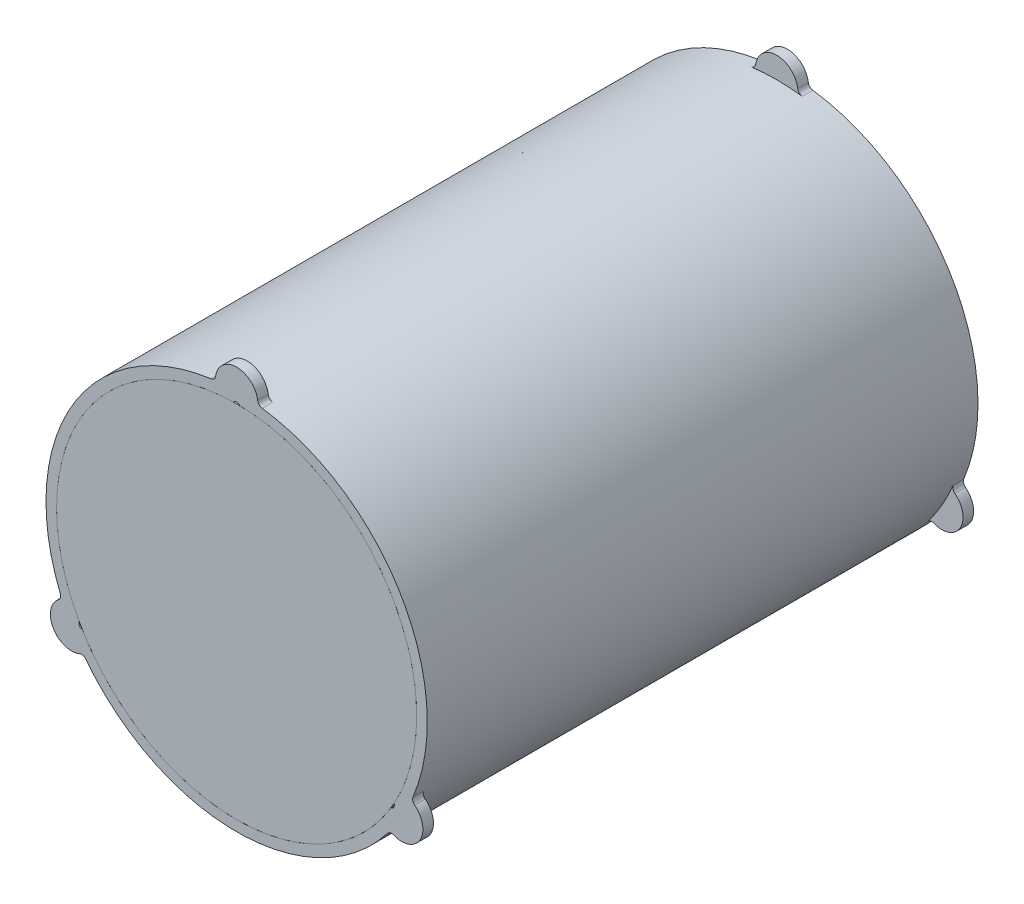
ISO-10303-21;
HEADER;
FILE_DESCRIPTION(('STEP AP214'),'2;1');
FILE_NAME('part.step','',(''),(''),'','','');
FILE_SCHEMA(('AUTOMOTIVE_DESIGN { 1 0 10303 214 1 1 1 1 }'));
ENDSEC;
DATA;
#1=APPLICATION_CONTEXT('core data for automotive mechanical design processes');
#2=APPLICATION_PROTOCOL_DEFINITION('international standard','automotive_design',2000,#1);
#3=PRODUCT_CONTEXT('',#1,'mechanical');
#4=PRODUCT('Part','Part','',(#3));
#5=PRODUCT_RELATED_PRODUCT_CATEGORY('part','',(#4));
#6=PRODUCT_DEFINITION_FORMATION('','',#4);
#7=PRODUCT_DEFINITION_CONTEXT('part definition',#1,'design');
#8=PRODUCT_DEFINITION('design','',#6,#7);
#9=PRODUCT_DEFINITION_SHAPE('','',#8);
#10=(LENGTH_UNIT() NAMED_UNIT(*) SI_UNIT(.MILLI.,.METRE.));
#11=(NAMED_UNIT(*) PLANE_ANGLE_UNIT() SI_UNIT($,.RADIAN.));
#12=(NAMED_UNIT(*) SI_UNIT($,.STERADIAN.) SOLID_ANGLE_UNIT());
#13=UNCERTAINTY_MEASURE_WITH_UNIT(LENGTH_MEASURE(1.E-05),#10,'distance_accuracy_value','');
#14=(GEOMETRIC_REPRESENTATION_CONTEXT(3) GLOBAL_UNCERTAINTY_ASSIGNED_CONTEXT((#13)) GLOBAL_UNIT_ASSIGNED_CONTEXT((#10,
#11,#12)) REPRESENTATION_CONTEXT('',''));
#15=CARTESIAN_POINT('',(0.,0.,0.));
#16=DIRECTION('',(0.,0.,1.));
#17=DIRECTION('',(1.,0.,0.));
#18=AXIS2_PLACEMENT_3D('',#15,#16,#17);
#19=CARTESIAN_POINT('',(0.,0.,330.2));
#20=DIRECTION('',(0.,0.,-1.));
#21=DIRECTION('',(-1.,0.,0.));
#22=AXIS2_PLACEMENT_3D('',#19,#20,#21);
#23=CYLINDRICAL_SURFACE('',#22,107.95);
#24=CARTESIAN_POINT('',(0.,0.,330.2));
#25=DIRECTION('',(0.,0.,1.));
#26=DIRECTION('',(1.,0.,0.));
#27=AXIS2_PLACEMENT_3D('',#24,#25,#26);
#28=CIRCLE('',#27,107.95);
#29=CARTESIAN_POINT('',(107.95,0.,330.2));
#30=VERTEX_POINT('',#29);
#31=EDGE_CURVE('E11',#30,#30,#28,.T.);
#32=ORIENTED_EDGE('',*,*,#31,.F.);
#33=EDGE_LOOP('',(#32));
#34=FACE_BOUND('',#33,.T.);
#35=CARTESIAN_POINT('',(0.,0.,0.));
#36=DIRECTION('',(0.,0.,1.));
#37=DIRECTION('',(1.,0.,0.));
#38=AXIS2_PLACEMENT_3D('',#35,#36,#37);
#39=CIRCLE('',#38,107.95);
#40=CARTESIAN_POINT('',(107.95,0.,0.));
#41=VERTEX_POINT('',#40);
#42=EDGE_CURVE('E48',#41,#41,#39,.T.);
#43=ORIENTED_EDGE('',*,*,#42,.T.);
#44=EDGE_LOOP('',(#43));
#45=FACE_BOUND('',#44,.T.);
#46=ADVANCED_FACE('F45',(#34,#45),#23,.T.);
#47=CARTESIAN_POINT('',(0.,0.,330.2));
#48=DIRECTION('',(0.,0.,1.));
#49=DIRECTION('',(1.,0.,0.));
#50=AXIS2_PLACEMENT_3D('',#47,#48,#49);
#51=PLANE('',#50);
#52=ORIENTED_EDGE('',*,*,#31,.T.);
#53=EDGE_LOOP('',(#52));
#54=FACE_BOUND('',#53,.T.);
#55=ADVANCED_FACE('F60',(#54),#51,.T.);
#56=CARTESIAN_POINT('',(0.,0.,0.));
#57=DIRECTION('',(0.,0.,1.));
#58=DIRECTION('',(1.,0.,0.));
#59=AXIS2_PLACEMENT_3D('',#56,#57,#58);
#60=PLANE('',#59);
#61=ORIENTED_EDGE('',*,*,#42,.F.);
#62=EDGE_LOOP('',(#61));
#63=FACE_BOUND('',#62,.T.);
#64=ADVANCED_FACE('F58',(#63),#60,.F.);
#65=CLOSED_SHELL('',(#46,#55,#64));
#66=MANIFOLD_SOLID_BREP('B2',#65);
#67=CARTESIAN_POINT('',(0.,0.,330.2));
#68=DIRECTION('',(0.,0.,-1.));
#69=DIRECTION('',(-1.,0.,0.));
#70=AXIS2_PLACEMENT_3D('',#67,#68,#69);
#71=CYLINDRICAL_SURFACE('',#70,107.95);
#72=DIRECTION('',(0.,0.,-1.));
#73=VECTOR('',#72,1.);
#74=CARTESIAN_POINT('',(1.88974907662165,107.933457965672,165.1));
#75=LINE('',#74,#73);
#76=CARTESIAN_POINT('',(1.88974907662171,107.933457965672,0.));
#77=VERTEX_POINT('',#76);
#78=CARTESIAN_POINT('',(1.88974907662164,107.933457965672,330.2));
#79=VERTEX_POINT('',#78);
#80=EDGE_CURVE('E281',#77,#79,#75,.F.);
#81=ORIENTED_EDGE('',*,*,#80,.F.);
#82=CARTESIAN_POINT('',(0.,0.,0.));
#83=DIRECTION('',(0.,0.,1.));
#84=DIRECTION('',(1.,0.,0.));
#85=AXIS2_PLACEMENT_3D('',#82,#83,#84);
#86=CIRCLE('',#85,107.95);
#87=CARTESIAN_POINT('',(94.4179910548822,-52.3301582757037,0.));
#88=VERTEX_POINT('',#87);
#89=EDGE_CURVE('E319',#88,#77,#86,.T.);
#90=ORIENTED_EDGE('',*,*,#89,.F.);
#91=DIRECTION('',(0.,0.,-1.));
#92=VECTOR('',#91,1.);
#93=CARTESIAN_POINT('',(94.4179910548821,-52.3301582757038,165.1));
#94=LINE('',#93,#92);
#95=CARTESIAN_POINT('',(94.4179910548821,-52.3301582757037,330.2));
#96=VERTEX_POINT('',#95);
#97=EDGE_CURVE('E307',#96,#88,#94,.T.);
#98=ORIENTED_EDGE('',*,*,#97,.F.);
#99=CARTESIAN_POINT('',(0.,0.,330.2));
#100=DIRECTION('',(0.,0.,1.));
#101=DIRECTION('',(1.,0.,0.));
#102=AXIS2_PLACEMENT_3D('',#99,#100,#101);
#103=CIRCLE('',#102,107.95);
#104=EDGE_CURVE('E301',#96,#79,#103,.T.);
#105=ORIENTED_EDGE('',*,*,#104,.T.);
#106=EDGE_LOOP('',(#81,#90,#98,#105));
#107=FACE_BOUND('',#106,.T.);
#108=ADVANCED_FACE('F86',(#107),#71,.F.);
#109=DIRECTION('',(0.,0.,-1.));
#110=VECTOR('',#109,1.);
#111=CARTESIAN_POINT('',(92.5282419782605,-55.6032996899688,165.1));
#112=LINE('',#111,#110);
#113=CARTESIAN_POINT('',(92.5282419782604,-55.6032996899689,0.));
#114=VERTEX_POINT('',#113);
#115=CARTESIAN_POINT('',(92.5282419782604,-55.6032996899688,330.2));
#116=VERTEX_POINT('',#115);
#117=EDGE_CURVE('E336',#114,#116,#112,.F.);
#118=ORIENTED_EDGE('',*,*,#117,.F.);
#119=CARTESIAN_POINT('',(-92.5282419782604,-55.6032996899689,0.));
#120=VERTEX_POINT('',#119);
#121=EDGE_CURVE('E312',#120,#114,#86,.T.);
#122=ORIENTED_EDGE('',*,*,#121,.F.);
#123=DIRECTION('',(0.,0.,-1.));
#124=VECTOR('',#123,1.);
#125=CARTESIAN_POINT('',(-92.5282419782605,-55.6032996899688,165.1));
#126=LINE('',#125,#124);
#127=CARTESIAN_POINT('',(-92.5282419782604,-55.6032996899689,330.2));
#128=VERTEX_POINT('',#127);
#129=EDGE_CURVE('E330',#128,#120,#126,.T.);
#130=ORIENTED_EDGE('',*,*,#129,.F.);
#131=EDGE_CURVE('E308',#128,#116,#103,.T.);
#132=ORIENTED_EDGE('',*,*,#131,.T.);
#133=EDGE_LOOP('',(#118,#122,#130,#132));
#134=FACE_BOUND('',#133,.T.);
#135=ADVANCED_FACE('F569',(#134),#71,.F.);
#136=CARTESIAN_POINT('',(0.,0.,330.2));
#137=DIRECTION('',(0.,0.,-1.));
#138=DIRECTION('',(-1.,0.,0.));
#139=AXIS2_PLACEMENT_3D('',#136,#137,#138);
#140=CYLINDRICAL_SURFACE('',#139,114.3);
#141=CARTESIAN_POINT('',(0.,0.,0.));
#142=DIRECTION('',(0.,0.,1.));
#143=DIRECTION('',(1.,0.,0.));
#144=AXIS2_PLACEMENT_3D('',#141,#142,#143);
#145=CIRCLE('',#144,114.3);
#146=CARTESIAN_POINT('',(-15.3080329533199,113.27027027027,0.));
#147=VERTEX_POINT('',#146);
#148=CARTESIAN_POINT('',(-105.748948024244,-43.3779897155902,0.));
#149=VERTEX_POINT('',#148);
#150=EDGE_CURVE('E329',#147,#149,#145,.T.);
#151=ORIENTED_EDGE('',*,*,#150,.T.);
#152=DIRECTION('',(0.,0.,-1.));
#153=VECTOR('',#152,1.);
#154=CARTESIAN_POINT('',(-105.748948024243,-43.3779897155902,330.2));
#155=LINE('',#154,#153);
#156=CARTESIAN_POINT('',(-105.748948024244,-43.3779897155902,6.35));
#157=VERTEX_POINT('',#156);
#158=EDGE_CURVE('E358',#149,#157,#155,.F.);
#159=ORIENTED_EDGE('',*,*,#158,.T.);
#160=CARTESIAN_POINT('',(0.,0.,6.35));
#161=DIRECTION('',(0.,0.,1.));
#162=DIRECTION('',(1.,0.,0.));
#163=AXIS2_PLACEMENT_3D('',#160,#161,#162);
#164=CIRCLE('',#163,114.3);
#165=CARTESIAN_POINT('',(-90.4409150709238,-69.8922805546789,6.35));
#166=VERTEX_POINT('',#165);
#167=EDGE_CURVE('E521',#157,#166,#164,.T.);
#168=ORIENTED_EDGE('',*,*,#167,.T.);
#169=DIRECTION('',(0.,0.,-1.));
#170=VECTOR('',#169,1.);
#171=CARTESIAN_POINT('',(-90.4409150709238,-69.8922805546789,330.2));
#172=LINE('',#171,#170);
#173=CARTESIAN_POINT('',(-90.4409150709238,-69.8922805546789,0.));
#174=VERTEX_POINT('',#173);
#175=EDGE_CURVE('E355',#166,#174,#172,.T.);
#176=ORIENTED_EDGE('',*,*,#175,.T.);
#177=CARTESIAN_POINT('',(90.4409150709233,-69.8922805546796,0.));
#178=VERTEX_POINT('',#177);
#179=EDGE_CURVE('E311',#174,#178,#145,.T.);
#180=ORIENTED_EDGE('',*,*,#179,.T.);
#181=DIRECTION('',(0.,0.,-1.));
#182=VECTOR('',#181,1.);
#183=CARTESIAN_POINT('',(90.4409150709233,-69.8922805546796,330.2));
#184=LINE('',#183,#182);
#185=CARTESIAN_POINT('',(90.4409150709233,-69.8922805546796,6.35));
#186=VERTEX_POINT('',#185);
#187=EDGE_CURVE('E349',#178,#186,#184,.F.);
#188=ORIENTED_EDGE('',*,*,#187,.T.);
#189=CARTESIAN_POINT('',(0.,0.,6.35));
#190=DIRECTION('',(0.,0.,1.));
#191=DIRECTION('',(1.,0.,0.));
#192=AXIS2_PLACEMENT_3D('',#189,#190,#191);
#193=CIRCLE('',#192,114.3);
#194=CARTESIAN_POINT('',(105.748948024243,-43.377989715591,6.35));
#195=VERTEX_POINT('',#194);
#196=EDGE_CURVE('E481',#195,#186,#193,.F.);
#197=ORIENTED_EDGE('',*,*,#196,.F.);
#198=DIRECTION('',(0.,0.,-1.));
#199=VECTOR('',#198,1.);
#200=CARTESIAN_POINT('',(105.748948024243,-43.377989715591,330.2));
#201=LINE('',#200,#199);
#202=CARTESIAN_POINT('',(105.748948024243,-43.377989715591,0.));
#203=VERTEX_POINT('',#202);
#204=EDGE_CURVE('E352',#195,#203,#201,.T.);
#205=ORIENTED_EDGE('',*,*,#204,.T.);
#206=CARTESIAN_POINT('',(15.3080329533199,113.27027027027,0.));
#207=VERTEX_POINT('',#206);
#208=EDGE_CURVE('E326',#203,#207,#145,.T.);
#209=ORIENTED_EDGE('',*,*,#208,.T.);
#210=DIRECTION('',(0.,0.,-1.));
#211=VECTOR('',#210,1.);
#212=CARTESIAN_POINT('',(15.3080329533199,113.27027027027,330.2));
#213=LINE('',#212,#211);
#214=CARTESIAN_POINT('',(15.3080329533199,113.27027027027,6.35));
#215=VERTEX_POINT('',#214);
#216=EDGE_CURVE('E343',#207,#215,#213,.F.);
#217=ORIENTED_EDGE('',*,*,#216,.T.);
#218=CARTESIAN_POINT('',(0.,0.,6.35));
#219=DIRECTION('',(0.,0.,1.));
#220=DIRECTION('',(1.,0.,0.));
#221=AXIS2_PLACEMENT_3D('',#218,#219,#220);
#222=CIRCLE('',#221,114.3);
#223=CARTESIAN_POINT('',(-15.3080329533199,113.27027027027,6.35));
#224=VERTEX_POINT('',#223);
#225=EDGE_CURVE('E469',#215,#224,#222,.T.);
#226=ORIENTED_EDGE('',*,*,#225,.T.);
#227=DIRECTION('',(0.,0.,-1.));
#228=VECTOR('',#227,1.);
#229=CARTESIAN_POINT('',(-15.3080329533199,113.27027027027,330.2));
#230=LINE('',#229,#228);
#231=EDGE_CURVE('E346',#224,#147,#230,.T.);
#232=ORIENTED_EDGE('',*,*,#231,.T.);
#233=EDGE_LOOP('',(#151,#159,#168,#176,#180,#188,#197,#205,#209,#217,#226,#232));
#234=FACE_BOUND('',#233,.T.);
#235=CARTESIAN_POINT('',(0.,0.,330.2));
#236=DIRECTION('',(0.,0.,1.));
#237=DIRECTION('',(1.,0.,0.));
#238=AXIS2_PLACEMENT_3D('',#235,#236,#237);
#239=CIRCLE('',#238,114.3);
#240=CARTESIAN_POINT('',(-15.3080329533199,113.27027027027,330.2));
#241=VERTEX_POINT('',#240);
#242=CARTESIAN_POINT('',(-105.748948024243,-43.3779897155917,330.2));
#243=VERTEX_POINT('',#242);
#244=EDGE_CURVE('E325',#241,#243,#239,.T.);
#245=ORIENTED_EDGE('',*,*,#244,.F.);
#246=DIRECTION('',(0.,0.,-1.));
#247=VECTOR('',#246,1.);
#248=CARTESIAN_POINT('',(-15.3080329533199,113.27027027027,330.2));
#249=LINE('',#248,#247);
#250=CARTESIAN_POINT('',(-15.3080329533199,113.27027027027,323.85));
#251=VERTEX_POINT('',#250);
#252=EDGE_CURVE('E376',#241,#251,#249,.T.);
#253=ORIENTED_EDGE('',*,*,#252,.T.);
#254=CARTESIAN_POINT('',(0.,0.,323.85));
#255=DIRECTION('',(0.,0.,1.));
#256=DIRECTION('',(1.,0.,0.));
#257=AXIS2_PLACEMENT_3D('',#254,#255,#256);
#258=CIRCLE('',#257,114.3);
#259=CARTESIAN_POINT('',(15.3080329533199,113.27027027027,323.85));
#260=VERTEX_POINT('',#259);
#261=EDGE_CURVE('E503',#260,#251,#258,.T.);
#262=ORIENTED_EDGE('',*,*,#261,.F.);
#263=DIRECTION('',(0.,0.,-1.));
#264=VECTOR('',#263,1.);
#265=CARTESIAN_POINT('',(15.3080329533199,113.27027027027,330.2));
#266=LINE('',#265,#264);
#267=CARTESIAN_POINT('',(15.3080329533199,113.27027027027,330.2));
#268=VERTEX_POINT('',#267);
#269=EDGE_CURVE('E373',#260,#268,#266,.F.);
#270=ORIENTED_EDGE('',*,*,#269,.T.);
#271=CARTESIAN_POINT('',(105.748948024243,-43.3779897155909,330.2));
#272=VERTEX_POINT('',#271);
#273=EDGE_CURVE('E321',#272,#268,#239,.T.);
#274=ORIENTED_EDGE('',*,*,#273,.F.);
#275=DIRECTION('',(0.,0.,-1.));
#276=VECTOR('',#275,1.);
#277=CARTESIAN_POINT('',(105.748948024243,-43.3779897155909,330.2));
#278=LINE('',#277,#276);
#279=CARTESIAN_POINT('',(105.748948024243,-43.3779897155909,323.85));
#280=VERTEX_POINT('',#279);
#281=EDGE_CURVE('E370',#272,#280,#278,.T.);
#282=ORIENTED_EDGE('',*,*,#281,.T.);
#283=CARTESIAN_POINT('',(0.,0.,323.85));
#284=DIRECTION('',(0.,0.,1.));
#285=DIRECTION('',(1.,0.,0.));
#286=AXIS2_PLACEMENT_3D('',#283,#284,#285);
#287=CIRCLE('',#286,114.3);
#288=CARTESIAN_POINT('',(90.4409150709234,-69.8922805546795,323.85));
#289=VERTEX_POINT('',#288);
#290=EDGE_CURVE('E499',#289,#280,#287,.T.);
#291=ORIENTED_EDGE('',*,*,#290,.F.);
#292=DIRECTION('',(0.,0.,-1.));
#293=VECTOR('',#292,1.);
#294=CARTESIAN_POINT('',(90.4409150709234,-69.8922805546795,330.2));
#295=LINE('',#294,#293);
#296=CARTESIAN_POINT('',(90.4409150709234,-69.8922805546795,330.2));
#297=VERTEX_POINT('',#296);
#298=EDGE_CURVE('E367',#289,#297,#295,.F.);
#299=ORIENTED_EDGE('',*,*,#298,.T.);
#300=CARTESIAN_POINT('',(-90.4409150709228,-69.8922805546802,330.2));
#301=VERTEX_POINT('',#300);
#302=EDGE_CURVE('E324',#301,#297,#239,.T.);
#303=ORIENTED_EDGE('',*,*,#302,.F.);
#304=DIRECTION('',(0.,0.,-1.));
#305=VECTOR('',#304,1.);
#306=CARTESIAN_POINT('',(-90.4409150709228,-69.8922805546802,330.2));
#307=LINE('',#306,#305);
#308=CARTESIAN_POINT('',(-90.4409150709228,-69.8922805546802,323.85));
#309=VERTEX_POINT('',#308);
#310=EDGE_CURVE('E364',#301,#309,#307,.T.);
#311=ORIENTED_EDGE('',*,*,#310,.T.);
#312=CARTESIAN_POINT('',(0.,0.,323.85));
#313=DIRECTION('',(0.,0.,1.));
#314=DIRECTION('',(1.,0.,0.));
#315=AXIS2_PLACEMENT_3D('',#312,#313,#314);
#316=CIRCLE('',#315,114.3);
#317=CARTESIAN_POINT('',(-105.748948024243,-43.3779897155917,323.85));
#318=VERTEX_POINT('',#317);
#319=EDGE_CURVE('E519',#318,#309,#316,.T.);
#320=ORIENTED_EDGE('',*,*,#319,.F.);
#321=DIRECTION('',(0.,0.,-1.));
#322=VECTOR('',#321,1.);
#323=CARTESIAN_POINT('',(-105.748948024243,-43.3779897155917,330.2));
#324=LINE('',#323,#322);
#325=EDGE_CURVE('E361',#318,#243,#324,.F.);
#326=ORIENTED_EDGE('',*,*,#325,.T.);
#327=EDGE_LOOP('',(#245,#253,#262,#270,#274,#282,#291,#299,#303,#311,#320,#326));
#328=FACE_BOUND('',#327,.T.);
#329=ADVANCED_FACE('F463',(#234,#328),#140,.T.);
#330=CARTESIAN_POINT('',(0.,0.,330.2));
#331=DIRECTION('',(0.,0.,1.));
#332=DIRECTION('',(1.,0.,0.));
#333=AXIS2_PLACEMENT_3D('',#330,#331,#332);
#334=PLANE('',#333);
#335=CARTESIAN_POINT('',(0.,106.3625,330.2));
#336=DIRECTION('',(0.,0.,-1.));
#337=DIRECTION('',(-1.,0.,0.));
#338=AXIS2_PLACEMENT_3D('',#335,#336,#337);
#339=CIRCLE('',#338,2.4574499999999);
#340=CARTESIAN_POINT('',(-1.88974907662166,107.933457965672,330.2));
#341=VERTEX_POINT('',#340);
#342=EDGE_CURVE('E284',#341,#79,#339,.T.);
#343=ORIENTED_EDGE('',*,*,#342,.T.);
#344=ORIENTED_EDGE('',*,*,#104,.F.);
#345=CARTESIAN_POINT('',(92.1126270100221,-53.1812500000004,330.2));
#346=DIRECTION('',(0.,0.,-1.));
#347=DIRECTION('',(-1.,0.,0.));
#348=AXIS2_PLACEMENT_3D('',#345,#346,#347);
#349=CIRCLE('',#348,2.4574499999999);
#350=EDGE_CURVE('E490',#96,#116,#349,.T.);
#351=ORIENTED_EDGE('',*,*,#350,.T.);
#352=ORIENTED_EDGE('',*,*,#131,.F.);
#353=CARTESIAN_POINT('',(-92.1126270100221,-53.1812500000004,330.2));
#354=DIRECTION('',(0.,0.,-1.));
#355=DIRECTION('',(-1.,0.,0.));
#356=AXIS2_PLACEMENT_3D('',#353,#354,#355);
#357=CIRCLE('',#356,2.4574499999999);
#358=CARTESIAN_POINT('',(-94.4179910548821,-52.3301582757038,330.2));
#359=VERTEX_POINT('',#358);
#360=EDGE_CURVE('E497',#128,#359,#357,.T.);
#361=ORIENTED_EDGE('',*,*,#360,.T.);
#362=EDGE_CURVE('E303',#341,#359,#103,.T.);
#363=ORIENTED_EDGE('',*,*,#362,.F.);
#364=EDGE_LOOP('',(#343,#344,#351,#352,#361,#363));
#365=FACE_BOUND('',#364,.T.);
#366=CARTESIAN_POINT('',(-98.9867036525609,-57.1500000000008,330.2));
#367=DIRECTION('',(0.,0.,1.));
#368=DIRECTION('',(1.,0.,0.));
#369=AXIS2_PLACEMENT_3D('',#366,#367,#368);
#370=CIRCLE('',#369,12.7);
#371=CARTESIAN_POINT('',(-94.1598708999376,-68.8969862338484,330.2));
#372=VERTEX_POINT('',#371);
#373=CARTESIAN_POINT('',(-106.746475772667,-47.0963470994867,330.2));
#374=VERTEX_POINT('',#373);
#375=EDGE_CURVE('E511',#372,#374,#370,.F.);
#376=ORIENTED_EDGE('',*,*,#375,.F.);
#377=CARTESIAN_POINT('',(-92.9531627117817,-71.8337327923102,330.2));
#378=DIRECTION('',(0.,0.,1.));
#379=DIRECTION('',(1.,0.,0.));
#380=AXIS2_PLACEMENT_3D('',#377,#378,#379);
#381=CIRCLE('',#380,3.175);
#382=EDGE_CURVE('E421',#372,#301,#381,.F.);
#383=ORIENTED_EDGE('',*,*,#382,.T.);
#384=ORIENTED_EDGE('',*,*,#302,.T.);
#385=CARTESIAN_POINT('',(92.9531627117823,-71.8337327923095,330.2));
#386=DIRECTION('',(0.,0.,1.));
#387=DIRECTION('',(1.,0.,0.));
#388=AXIS2_PLACEMENT_3D('',#385,#386,#387);
#389=CIRCLE('',#388,3.175);
#390=CARTESIAN_POINT('',(94.1598708999381,-68.8969862338477,330.2));
#391=VERTEX_POINT('',#390);
#392=EDGE_CURVE('E416',#297,#391,#389,.F.);
#393=ORIENTED_EDGE('',*,*,#392,.T.);
#394=CARTESIAN_POINT('',(98.9867036525613,-57.1500000000001,330.2));
#395=DIRECTION('',(0.,0.,1.));
#396=DIRECTION('',(1.,0.,0.));
#397=AXIS2_PLACEMENT_3D('',#394,#395,#396);
#398=CIRCLE('',#397,12.7);
#399=CARTESIAN_POINT('',(106.746475772668,-47.0963470994859,330.2));
#400=VERTEX_POINT('',#399);
#401=EDGE_CURVE('E500',#400,#391,#398,.F.);
#402=ORIENTED_EDGE('',*,*,#401,.F.);
#403=CARTESIAN_POINT('',(108.686418802694,-44.5829338743573,330.2));
#404=DIRECTION('',(0.,0.,1.));
#405=DIRECTION('',(1.,0.,0.));
#406=AXIS2_PLACEMENT_3D('',#403,#404,#405);
#407=CIRCLE('',#406,3.175);
#408=EDGE_CURVE('E412',#400,#272,#407,.F.);
#409=ORIENTED_EDGE('',*,*,#408,.T.);
#410=ORIENTED_EDGE('',*,*,#273,.T.);
#411=CARTESIAN_POINT('',(15.7332560909121,116.416666666667,330.2));
#412=DIRECTION('',(0.,0.,1.));
#413=DIRECTION('',(1.,0.,0.));
#414=AXIS2_PLACEMENT_3D('',#411,#412,#413);
#415=CIRCLE('',#414,3.175);
#416=CARTESIAN_POINT('',(12.5866048727297,115.993333333333,330.2));
#417=VERTEX_POINT('',#416);
#418=EDGE_CURVE('E407',#268,#417,#415,.F.);
#419=ORIENTED_EDGE('',*,*,#418,.T.);
#420=CARTESIAN_POINT('',(0.,114.3,330.2));
#421=DIRECTION('',(0.,0.,1.));
#422=DIRECTION('',(1.,0.,0.));
#423=AXIS2_PLACEMENT_3D('',#420,#421,#422);
#424=CIRCLE('',#423,12.7);
#425=CARTESIAN_POINT('',(-12.5866048727297,115.993333333333,330.2));
#426=VERTEX_POINT('',#425);
#427=EDGE_CURVE('E508',#426,#417,#424,.F.);
#428=ORIENTED_EDGE('',*,*,#427,.F.);
#429=CARTESIAN_POINT('',(-15.7332560909121,116.416666666667,330.2));
#430=DIRECTION('',(0.,0.,1.));
#431=DIRECTION('',(1.,0.,0.));
#432=AXIS2_PLACEMENT_3D('',#429,#430,#431);
#433=CIRCLE('',#432,3.175);
#434=EDGE_CURVE('E403',#426,#241,#433,.F.);
#435=ORIENTED_EDGE('',*,*,#434,.T.);
#436=ORIENTED_EDGE('',*,*,#244,.T.);
#437=CARTESIAN_POINT('',(-108.686418802694,-44.5829338743581,330.2));
#438=DIRECTION('',(0.,0.,1.));
#439=DIRECTION('',(1.,0.,0.));
#440=AXIS2_PLACEMENT_3D('',#437,#438,#439);
#441=CIRCLE('',#440,3.175);
#442=EDGE_CURVE('E425',#243,#374,#441,.F.);
#443=ORIENTED_EDGE('',*,*,#442,.T.);
#444=EDGE_LOOP('',(#376,#383,#384,#393,#402,#409,#410,#419,#428,#435,#436,#443));
#445=FACE_BOUND('',#444,.T.);
#446=ADVANCED_FACE('F298',(#365,#445),#334,.T.);
#447=CARTESIAN_POINT('',(0.,0.,0.));
#448=DIRECTION('',(0.,0.,1.));
#449=DIRECTION('',(1.,0.,0.));
#450=AXIS2_PLACEMENT_3D('',#447,#448,#449);
#451=PLANE('',#450);
#452=ORIENTED_EDGE('',*,*,#208,.F.);
#453=CARTESIAN_POINT('',(108.686418802694,-44.5829338743574,0.));
#454=DIRECTION('',(0.,0.,1.));
#455=DIRECTION('',(1.,0.,0.));
#456=AXIS2_PLACEMENT_3D('',#453,#454,#455);
#457=CIRCLE('',#456,3.175);
#458=CARTESIAN_POINT('',(106.746475772668,-47.0963470994859,0.));
#459=VERTEX_POINT('',#458);
#460=EDGE_CURVE('E439',#203,#459,#457,.T.);
#461=ORIENTED_EDGE('',*,*,#460,.T.);
#462=CARTESIAN_POINT('',(98.9867036525613,-57.1500000000001,0.));
#463=DIRECTION('',(0.,0.,1.));
#464=DIRECTION('',(1.,0.,0.));
#465=AXIS2_PLACEMENT_3D('',#462,#463,#464);
#466=CIRCLE('',#465,12.7);
#467=CARTESIAN_POINT('',(94.1598708999381,-68.8969862338477,0.));
#468=VERTEX_POINT('',#467);
#469=EDGE_CURVE('E315',#459,#468,#466,.F.);
#470=ORIENTED_EDGE('',*,*,#469,.T.);
#471=CARTESIAN_POINT('',(92.9531627117823,-71.8337327923096,0.));
#472=DIRECTION('',(0.,0.,1.));
#473=DIRECTION('',(1.,0.,0.));
#474=AXIS2_PLACEMENT_3D('',#471,#472,#473);
#475=CIRCLE('',#474,3.175);
#476=EDGE_CURVE('E444',#468,#178,#475,.T.);
#477=ORIENTED_EDGE('',*,*,#476,.T.);
#478=ORIENTED_EDGE('',*,*,#179,.F.);
#479=CARTESIAN_POINT('',(-92.9531627117828,-71.8337327923089,0.));
#480=DIRECTION('',(0.,0.,1.));
#481=DIRECTION('',(1.,0.,0.));
#482=AXIS2_PLACEMENT_3D('',#479,#480,#481);
#483=CIRCLE('',#482,3.175);
#484=CARTESIAN_POINT('',(-94.1598708999386,-68.896986233847,0.));
#485=VERTEX_POINT('',#484);
#486=EDGE_CURVE('E434',#174,#485,#483,.T.);
#487=ORIENTED_EDGE('',*,*,#486,.T.);
#488=CARTESIAN_POINT('',(-98.9867036525617,-57.1499999999994,0.));
#489=DIRECTION('',(0.,0.,-1.));
#490=DIRECTION('',(-1.,0.,0.));
#491=AXIS2_PLACEMENT_3D('',#488,#489,#490);
#492=CIRCLE('',#491,12.7);
#493=CARTESIAN_POINT('',(-106.746475772668,-47.0963470994852,0.));
#494=VERTEX_POINT('',#493);
#495=EDGE_CURVE('E470',#485,#494,#492,.T.);
#496=ORIENTED_EDGE('',*,*,#495,.T.);
#497=CARTESIAN_POINT('',(-108.686418802695,-44.5829338743566,0.));
#498=DIRECTION('',(0.,0.,1.));
#499=DIRECTION('',(1.,0.,0.));
#500=AXIS2_PLACEMENT_3D('',#497,#498,#499);
#501=CIRCLE('',#500,3.175);
#502=EDGE_CURVE('E430',#494,#149,#501,.T.);
#503=ORIENTED_EDGE('',*,*,#502,.T.);
#504=ORIENTED_EDGE('',*,*,#150,.F.);
#505=CARTESIAN_POINT('',(-15.7332560909121,116.416666666667,0.));
#506=DIRECTION('',(0.,0.,1.));
#507=DIRECTION('',(1.,0.,0.));
#508=AXIS2_PLACEMENT_3D('',#505,#506,#507);
#509=CIRCLE('',#508,3.175);
#510=CARTESIAN_POINT('',(-12.5866048727297,115.993333333333,0.));
#511=VERTEX_POINT('',#510);
#512=EDGE_CURVE('E448',#147,#511,#509,.T.);
#513=ORIENTED_EDGE('',*,*,#512,.T.);
#514=CARTESIAN_POINT('',(0.,114.3,0.));
#515=DIRECTION('',(0.,0.,1.));
#516=DIRECTION('',(1.,0.,0.));
#517=AXIS2_PLACEMENT_3D('',#514,#515,#516);
#518=CIRCLE('',#517,12.7);
#519=CARTESIAN_POINT('',(12.5866048727297,115.993333333333,0.));
#520=VERTEX_POINT('',#519);
#521=EDGE_CURVE('E457',#520,#511,#518,.T.);
#522=ORIENTED_EDGE('',*,*,#521,.F.);
#523=CARTESIAN_POINT('',(15.7332560909121,116.416666666667,0.));
#524=DIRECTION('',(0.,0.,1.));
#525=DIRECTION('',(1.,0.,0.));
#526=AXIS2_PLACEMENT_3D('',#523,#524,#525);
#527=CIRCLE('',#526,3.175);
#528=EDGE_CURVE('E94',#520,#207,#527,.T.);
#529=ORIENTED_EDGE('',*,*,#528,.T.);
#530=EDGE_LOOP('',(#452,#461,#470,#477,#478,#487,#496,#503,#504,#513,#522,#529));
#531=FACE_BOUND('',#530,.T.);
#532=ORIENTED_EDGE('',*,*,#89,.T.);
#533=CARTESIAN_POINT('',(0.,106.3625,0.));
#534=DIRECTION('',(0.,0.,-1.));
#535=DIRECTION('',(-1.,0.,0.));
#536=AXIS2_PLACEMENT_3D('',#533,#534,#535);
#537=CIRCLE('',#536,2.45744999999999);
#538=CARTESIAN_POINT('',(-1.88974907662171,107.933457965672,0.));
#539=VERTEX_POINT('',#538);
#540=EDGE_CURVE('E287',#539,#77,#537,.T.);
#541=ORIENTED_EDGE('',*,*,#540,.F.);
#542=CARTESIAN_POINT('',(-94.4179910548822,-52.3301582757037,0.));
#543=VERTEX_POINT('',#542);
#544=EDGE_CURVE('E320',#539,#543,#86,.T.);
#545=ORIENTED_EDGE('',*,*,#544,.T.);
#546=CARTESIAN_POINT('',(-92.1126270100221,-53.1812500000004,0.));
#547=DIRECTION('',(0.,0.,-1.));
#548=DIRECTION('',(-1.,0.,0.));
#549=AXIS2_PLACEMENT_3D('',#546,#547,#548);
#550=CIRCLE('',#549,2.45744999999999);
#551=EDGE_CURVE('E492',#120,#543,#550,.T.);
#552=ORIENTED_EDGE('',*,*,#551,.F.);
#553=ORIENTED_EDGE('',*,*,#121,.T.);
#554=CARTESIAN_POINT('',(92.1126270100221,-53.1812500000004,0.));
#555=DIRECTION('',(0.,0.,-1.));
#556=DIRECTION('',(-1.,0.,0.));
#557=AXIS2_PLACEMENT_3D('',#554,#555,#556);
#558=CIRCLE('',#557,2.45744999999999);
#559=EDGE_CURVE('E304',#88,#114,#558,.T.);
#560=ORIENTED_EDGE('',*,*,#559,.F.);
#561=EDGE_LOOP('',(#532,#541,#545,#552,#553,#560));
#562=FACE_BOUND('',#561,.T.);
#563=ADVANCED_FACE('F455',(#531,#562),#451,.F.);
#564=DIRECTION('',(0.,0.,-1.));
#565=VECTOR('',#564,1.);
#566=CARTESIAN_POINT('',(-1.88974907662165,107.933457965672,165.1));
#567=LINE('',#566,#565);
#568=EDGE_CURVE('E293',#341,#539,#567,.T.);
#569=ORIENTED_EDGE('',*,*,#568,.F.);
#570=ORIENTED_EDGE('',*,*,#362,.T.);
#571=DIRECTION('',(0.,0.,-1.));
#572=VECTOR('',#571,1.);
#573=CARTESIAN_POINT('',(-94.4179910548821,-52.3301582757038,165.1));
#574=LINE('',#573,#572);
#575=EDGE_CURVE('E332',#543,#359,#574,.F.);
#576=ORIENTED_EDGE('',*,*,#575,.F.);
#577=ORIENTED_EDGE('',*,*,#544,.F.);
#578=EDGE_LOOP('',(#569,#570,#576,#577));
#579=FACE_BOUND('',#578,.T.);
#580=ADVANCED_FACE('F571',(#579),#71,.F.);
#581=CARTESIAN_POINT('',(98.9867036525613,-57.1500000000001,6.35));
#582=DIRECTION('',(0.,0.,-1.));
#583=DIRECTION('',(-1.,0.,0.));
#584=AXIS2_PLACEMENT_3D('',#581,#582,#583);
#585=CYLINDRICAL_SURFACE('',#584,12.7);
#586=ORIENTED_EDGE('',*,*,#469,.F.);
#587=DIRECTION('',(0.,0.,-1.));
#588=VECTOR('',#587,1.);
#589=CARTESIAN_POINT('',(106.746475772668,-47.0963470994859,6.35));
#590=LINE('',#589,#588);
#591=CARTESIAN_POINT('',(106.746475772668,-47.0963470994859,6.35));
#592=VERTEX_POINT('',#591);
#593=EDGE_CURVE('E397',#459,#592,#590,.F.);
#594=ORIENTED_EDGE('',*,*,#593,.T.);
#595=CARTESIAN_POINT('',(98.9867036525613,-57.1500000000001,6.35));
#596=DIRECTION('',(0.,0.,1.));
#597=DIRECTION('',(1.,0.,0.));
#598=AXIS2_PLACEMENT_3D('',#595,#596,#597);
#599=CIRCLE('',#598,12.7);
#600=CARTESIAN_POINT('',(94.1598708999381,-68.8969862338477,6.35));
#601=VERTEX_POINT('',#600);
#602=EDGE_CURVE('E479',#592,#601,#599,.F.);
#603=ORIENTED_EDGE('',*,*,#602,.T.);
#604=DIRECTION('',(0.,0.,-1.));
#605=VECTOR('',#604,1.);
#606=CARTESIAN_POINT('',(94.1598708999381,-68.8969862338477,6.35));
#607=LINE('',#606,#605);
#608=EDGE_CURVE('E394',#601,#468,#607,.T.);
#609=ORIENTED_EDGE('',*,*,#608,.T.);
#610=EDGE_LOOP('',(#586,#594,#603,#609));
#611=FACE_BOUND('',#610,.T.);
#612=ADVANCED_FACE('F552',(#611),#585,.T.);
#613=CARTESIAN_POINT('',(0.,0.,6.35));
#614=DIRECTION('',(0.,0.,1.));
#615=DIRECTION('',(1.,0.,0.));
#616=AXIS2_PLACEMENT_3D('',#613,#614,#615);
#617=PLANE('',#616);
#618=ORIENTED_EDGE('',*,*,#602,.F.);
#619=CARTESIAN_POINT('',(108.686418802694,-44.5829338743574,6.35));
#620=DIRECTION('',(0.,0.,1.));
#621=DIRECTION('',(1.,0.,0.));
#622=AXIS2_PLACEMENT_3D('',#619,#620,#621);
#623=CIRCLE('',#622,3.175);
#624=EDGE_CURVE('E441',#592,#195,#623,.F.);
#625=ORIENTED_EDGE('',*,*,#624,.T.);
#626=ORIENTED_EDGE('',*,*,#196,.T.);
#627=CARTESIAN_POINT('',(92.9531627117823,-71.8337327923096,6.35000000000002));
#628=DIRECTION('',(0.,0.,1.));
#629=DIRECTION('',(1.,0.,0.));
#630=AXIS2_PLACEMENT_3D('',#627,#628,#629);
#631=CIRCLE('',#630,3.175);
#632=EDGE_CURVE('E446',#186,#601,#631,.F.);
#633=ORIENTED_EDGE('',*,*,#632,.T.);
#634=EDGE_LOOP('',(#618,#625,#626,#633));
#635=FACE_BOUND('',#634,.T.);
#636=ADVANCED_FACE('F548',(#635),#617,.T.);
#637=CARTESIAN_POINT('',(0.,114.3,6.35));
#638=DIRECTION('',(0.,0.,-1.));
#639=DIRECTION('',(-1.,0.,0.));
#640=AXIS2_PLACEMENT_3D('',#637,#638,#639);
#641=CYLINDRICAL_SURFACE('',#640,12.7);
#642=ORIENTED_EDGE('',*,*,#521,.T.);
#643=DIRECTION('',(0.,0.,-1.));
#644=VECTOR('',#643,1.);
#645=CARTESIAN_POINT('',(-12.5866048727297,115.993333333333,6.35));
#646=LINE('',#645,#644);
#647=CARTESIAN_POINT('',(-12.5866048727297,115.993333333333,6.35));
#648=VERTEX_POINT('',#647);
#649=EDGE_CURVE('E101',#511,#648,#646,.F.);
#650=ORIENTED_EDGE('',*,*,#649,.T.);
#651=CARTESIAN_POINT('',(0.,114.3,6.35));
#652=DIRECTION('',(0.,0.,1.));
#653=DIRECTION('',(1.,0.,0.));
#654=AXIS2_PLACEMENT_3D('',#651,#652,#653);
#655=CIRCLE('',#654,12.7);
#656=CARTESIAN_POINT('',(12.5866048727297,115.993333333333,6.35));
#657=VERTEX_POINT('',#656);
#658=EDGE_CURVE('E467',#657,#648,#655,.T.);
#659=ORIENTED_EDGE('',*,*,#658,.F.);
#660=DIRECTION('',(0.,0.,-1.));
#661=VECTOR('',#660,1.);
#662=CARTESIAN_POINT('',(12.5866048727297,115.993333333333,6.35));
#663=LINE('',#662,#661);
#664=EDGE_CURVE('E399',#657,#520,#663,.T.);
#665=ORIENTED_EDGE('',*,*,#664,.T.);
#666=EDGE_LOOP('',(#642,#650,#659,#665));
#667=FACE_BOUND('',#666,.T.);
#668=ADVANCED_FACE('F466',(#667),#641,.T.);
#669=CARTESIAN_POINT('',(0.,0.,6.35));
#670=DIRECTION('',(0.,0.,1.));
#671=DIRECTION('',(1.,0.,0.));
#672=AXIS2_PLACEMENT_3D('',#669,#670,#671);
#673=PLANE('',#672);
#674=ORIENTED_EDGE('',*,*,#225,.F.);
#675=CARTESIAN_POINT('',(15.7332560909121,116.416666666667,6.35000000000002));
#676=DIRECTION('',(0.,0.,1.));
#677=DIRECTION('',(1.,0.,0.));
#678=AXIS2_PLACEMENT_3D('',#675,#676,#677);
#679=CIRCLE('',#678,3.175);
#680=EDGE_CURVE('E43',#215,#657,#679,.F.);
#681=ORIENTED_EDGE('',*,*,#680,.T.);
#682=ORIENTED_EDGE('',*,*,#658,.T.);
#683=CARTESIAN_POINT('',(-15.7332560909121,116.416666666667,6.35));
#684=DIRECTION('',(0.,0.,1.));
#685=DIRECTION('',(1.,0.,0.));
#686=AXIS2_PLACEMENT_3D('',#683,#684,#685);
#687=CIRCLE('',#686,3.175);
#688=EDGE_CURVE('E450',#648,#224,#687,.F.);
#689=ORIENTED_EDGE('',*,*,#688,.T.);
#690=EDGE_LOOP('',(#674,#681,#682,#689));
#691=FACE_BOUND('',#690,.T.);
#692=ADVANCED_FACE('F628',(#691),#673,.T.);
#693=CARTESIAN_POINT('',(-98.9867036525617,-57.1499999999994,6.35));
#694=DIRECTION('',(0.,0.,-1.));
#695=DIRECTION('',(-1.,0.,0.));
#696=AXIS2_PLACEMENT_3D('',#693,#694,#695);
#697=CYLINDRICAL_SURFACE('',#696,12.7);
#698=CARTESIAN_POINT('',(-98.9867036525617,-57.1499999999994,6.35));
#699=DIRECTION('',(0.,0.,-1.));
#700=DIRECTION('',(-1.,0.,0.));
#701=AXIS2_PLACEMENT_3D('',#698,#699,#700);
#702=CIRCLE('',#701,12.7);
#703=CARTESIAN_POINT('',(-94.1598708999386,-68.896986233847,6.35));
#704=VERTEX_POINT('',#703);
#705=CARTESIAN_POINT('',(-106.746475772668,-47.0963470994852,6.35));
#706=VERTEX_POINT('',#705);
#707=EDGE_CURVE('E474',#704,#706,#702,.T.);
#708=ORIENTED_EDGE('',*,*,#707,.T.);
#709=DIRECTION('',(0.,0.,-1.));
#710=VECTOR('',#709,1.);
#711=CARTESIAN_POINT('',(-106.746475772668,-47.0963470994852,6.35));
#712=LINE('',#711,#710);
#713=EDGE_CURVE('E391',#706,#494,#712,.T.);
#714=ORIENTED_EDGE('',*,*,#713,.T.);
#715=ORIENTED_EDGE('',*,*,#495,.F.);
#716=DIRECTION('',(0.,0.,-1.));
#717=VECTOR('',#716,1.);
#718=CARTESIAN_POINT('',(-94.1598708999386,-68.896986233847,6.35));
#719=LINE('',#718,#717);
#720=EDGE_CURVE('E389',#485,#704,#719,.F.);
#721=ORIENTED_EDGE('',*,*,#720,.T.);
#722=EDGE_LOOP('',(#708,#714,#715,#721));
#723=FACE_BOUND('',#722,.T.);
#724=ADVANCED_FACE('F528',(#723),#697,.T.);
#725=CARTESIAN_POINT('',(-49.4933518262808,-28.5749999999997,6.35));
#726=DIRECTION('',(0.,0.,-1.));
#727=DIRECTION('',(-1.,0.,0.));
#728=AXIS2_PLACEMENT_3D('',#725,#726,#727);
#729=PLANE('',#728);
#730=ORIENTED_EDGE('',*,*,#707,.F.);
#731=CARTESIAN_POINT('',(-92.9531627117828,-71.8337327923089,6.35));
#732=DIRECTION('',(0.,0.,-1.));
#733=DIRECTION('',(-1.,0.,0.));
#734=AXIS2_PLACEMENT_3D('',#731,#732,#733);
#735=CIRCLE('',#734,3.175);
#736=EDGE_CURVE('E436',#704,#166,#735,.T.);
#737=ORIENTED_EDGE('',*,*,#736,.T.);
#738=ORIENTED_EDGE('',*,*,#167,.F.);
#739=CARTESIAN_POINT('',(-108.686418802695,-44.5829338743566,6.35000000000002));
#740=DIRECTION('',(0.,0.,-1.));
#741=DIRECTION('',(-1.,0.,0.));
#742=AXIS2_PLACEMENT_3D('',#739,#740,#741);
#743=CIRCLE('',#742,3.175);
#744=EDGE_CURVE('E432',#157,#706,#743,.T.);
#745=ORIENTED_EDGE('',*,*,#744,.T.);
#746=EDGE_LOOP('',(#730,#737,#738,#745));
#747=FACE_BOUND('',#746,.T.);
#748=ADVANCED_FACE('F624',(#747),#729,.F.);
#749=CARTESIAN_POINT('',(-98.9867036525609,-57.1500000000008,323.85));
#750=DIRECTION('',(0.,0.,1.));
#751=DIRECTION('',(1.,0.,0.));
#752=AXIS2_PLACEMENT_3D('',#749,#750,#751);
#753=CYLINDRICAL_SURFACE('',#752,12.7);
#754=CARTESIAN_POINT('',(-98.9867036525609,-57.1500000000008,323.85));
#755=DIRECTION('',(0.,0.,1.));
#756=DIRECTION('',(1.,0.,0.));
#757=AXIS2_PLACEMENT_3D('',#754,#755,#756);
#758=CIRCLE('',#757,12.7);
#759=CARTESIAN_POINT('',(-94.1598708999376,-68.8969862338484,323.85));
#760=VERTEX_POINT('',#759);
#761=CARTESIAN_POINT('',(-106.746475772667,-47.0963470994867,323.85));
#762=VERTEX_POINT('',#761);
#763=EDGE_CURVE('E516',#760,#762,#758,.F.);
#764=ORIENTED_EDGE('',*,*,#763,.F.);
#765=DIRECTION('',(0.,0.,1.));
#766=VECTOR('',#765,1.);
#767=CARTESIAN_POINT('',(-94.1598708999376,-68.8969862338484,323.85));
#768=LINE('',#767,#766);
#769=EDGE_CURVE('E386',#760,#372,#768,.T.);
#770=ORIENTED_EDGE('',*,*,#769,.T.);
#771=ORIENTED_EDGE('',*,*,#375,.T.);
#772=DIRECTION('',(0.,0.,1.));
#773=VECTOR('',#772,1.);
#774=CARTESIAN_POINT('',(-106.746475772667,-47.0963470994867,323.85));
#775=LINE('',#774,#773);
#776=EDGE_CURVE('E384',#374,#762,#775,.F.);
#777=ORIENTED_EDGE('',*,*,#776,.T.);
#778=EDGE_LOOP('',(#764,#770,#771,#777));
#779=FACE_BOUND('',#778,.T.);
#780=ADVANCED_FACE('F620',(#779),#753,.T.);
#781=CARTESIAN_POINT('',(0.,0.,323.85));
#782=DIRECTION('',(0.,0.,1.));
#783=DIRECTION('',(1.,0.,0.));
#784=AXIS2_PLACEMENT_3D('',#781,#782,#783);
#785=PLANE('',#784);
#786=ORIENTED_EDGE('',*,*,#319,.T.);
#787=CARTESIAN_POINT('',(-92.9531627117817,-71.8337327923102,323.85));
#788=DIRECTION('',(0.,0.,1.));
#789=DIRECTION('',(1.,0.,0.));
#790=AXIS2_PLACEMENT_3D('',#787,#788,#789);
#791=CIRCLE('',#790,3.175);
#792=EDGE_CURVE('E423',#309,#760,#791,.T.);
#793=ORIENTED_EDGE('',*,*,#792,.T.);
#794=ORIENTED_EDGE('',*,*,#763,.T.);
#795=CARTESIAN_POINT('',(-108.686418802694,-44.5829338743581,323.85));
#796=DIRECTION('',(0.,0.,1.));
#797=DIRECTION('',(1.,0.,0.));
#798=AXIS2_PLACEMENT_3D('',#795,#796,#797);
#799=CIRCLE('',#798,3.175);
#800=EDGE_CURVE('E427',#762,#318,#799,.T.);
#801=ORIENTED_EDGE('',*,*,#800,.T.);
#802=EDGE_LOOP('',(#786,#793,#794,#801));
#803=FACE_BOUND('',#802,.T.);
#804=ADVANCED_FACE('F613',(#803),#785,.F.);
#805=CARTESIAN_POINT('',(0.,114.3,323.85));
#806=DIRECTION('',(0.,0.,1.));
#807=DIRECTION('',(1.,0.,0.));
#808=AXIS2_PLACEMENT_3D('',#805,#806,#807);
#809=CYLINDRICAL_SURFACE('',#808,12.7);
#810=CARTESIAN_POINT('',(0.,114.3,323.85));
#811=DIRECTION('',(0.,0.,1.));
#812=DIRECTION('',(1.,0.,0.));
#813=AXIS2_PLACEMENT_3D('',#810,#811,#812);
#814=CIRCLE('',#813,12.7);
#815=CARTESIAN_POINT('',(-12.5866048727297,115.993333333333,323.85));
#816=VERTEX_POINT('',#815);
#817=CARTESIAN_POINT('',(12.5866048727297,115.993333333333,323.85));
#818=VERTEX_POINT('',#817);
#819=EDGE_CURVE('E512',#816,#818,#814,.F.);
#820=ORIENTED_EDGE('',*,*,#819,.F.);
#821=DIRECTION('',(0.,0.,1.));
#822=VECTOR('',#821,1.);
#823=CARTESIAN_POINT('',(-12.5866048727297,115.993333333333,323.85));
#824=LINE('',#823,#822);
#825=EDGE_CURVE('E340',#816,#426,#824,.T.);
#826=ORIENTED_EDGE('',*,*,#825,.T.);
#827=ORIENTED_EDGE('',*,*,#427,.T.);
#828=DIRECTION('',(0.,0.,1.));
#829=VECTOR('',#828,1.);
#830=CARTESIAN_POINT('',(12.5866048727297,115.993333333333,323.85));
#831=LINE('',#830,#829);
#832=EDGE_CURVE('E292',#417,#818,#831,.F.);
#833=ORIENTED_EDGE('',*,*,#832,.T.);
#834=EDGE_LOOP('',(#820,#826,#827,#833));
#835=FACE_BOUND('',#834,.T.);
#836=ADVANCED_FACE('F610',(#835),#809,.T.);
#837=CARTESIAN_POINT('',(0.,0.,323.85));
#838=DIRECTION('',(0.,0.,1.));
#839=DIRECTION('',(1.,0.,0.));
#840=AXIS2_PLACEMENT_3D('',#837,#838,#839);
#841=PLANE('',#840);
#842=ORIENTED_EDGE('',*,*,#261,.T.);
#843=CARTESIAN_POINT('',(-15.7332560909121,116.416666666667,323.85));
#844=DIRECTION('',(0.,0.,1.));
#845=DIRECTION('',(1.,0.,0.));
#846=AXIS2_PLACEMENT_3D('',#843,#844,#845);
#847=CIRCLE('',#846,3.175);
#848=EDGE_CURVE('E405',#251,#816,#847,.T.);
#849=ORIENTED_EDGE('',*,*,#848,.T.);
#850=ORIENTED_EDGE('',*,*,#819,.T.);
#851=CARTESIAN_POINT('',(15.7332560909121,116.416666666667,323.85));
#852=DIRECTION('',(0.,0.,1.));
#853=DIRECTION('',(1.,0.,0.));
#854=AXIS2_PLACEMENT_3D('',#851,#852,#853);
#855=CIRCLE('',#854,3.175);
#856=EDGE_CURVE('E409',#818,#260,#855,.T.);
#857=ORIENTED_EDGE('',*,*,#856,.T.);
#858=EDGE_LOOP('',(#842,#849,#850,#857));
#859=FACE_BOUND('',#858,.T.);
#860=ADVANCED_FACE('F605',(#859),#841,.F.);
#861=CARTESIAN_POINT('',(98.9867036525613,-57.1500000000001,323.85));
#862=DIRECTION('',(0.,0.,1.));
#863=DIRECTION('',(1.,0.,0.));
#864=AXIS2_PLACEMENT_3D('',#861,#862,#863);
#865=CYLINDRICAL_SURFACE('',#864,12.7);
#866=CARTESIAN_POINT('',(98.9867036525613,-57.1500000000001,323.85));
#867=DIRECTION('',(0.,0.,1.));
#868=DIRECTION('',(1.,0.,0.));
#869=AXIS2_PLACEMENT_3D('',#866,#867,#868);
#870=CIRCLE('',#869,12.7);
#871=CARTESIAN_POINT('',(106.746475772668,-47.0963470994859,323.85));
#872=VERTEX_POINT('',#871);
#873=CARTESIAN_POINT('',(94.1598708999381,-68.8969862338477,323.85));
#874=VERTEX_POINT('',#873);
#875=EDGE_CURVE('E504',#872,#874,#870,.F.);
#876=ORIENTED_EDGE('',*,*,#875,.F.);
#877=DIRECTION('',(0.,0.,1.));
#878=VECTOR('',#877,1.);
#879=CARTESIAN_POINT('',(106.746475772668,-47.0963470994859,323.85));
#880=LINE('',#879,#878);
#881=EDGE_CURVE('E381',#872,#400,#880,.T.);
#882=ORIENTED_EDGE('',*,*,#881,.T.);
#883=ORIENTED_EDGE('',*,*,#401,.T.);
#884=DIRECTION('',(0.,0.,1.));
#885=VECTOR('',#884,1.);
#886=CARTESIAN_POINT('',(94.1598708999381,-68.8969862338477,323.85));
#887=LINE('',#886,#885);
#888=EDGE_CURVE('E379',#391,#874,#887,.F.);
#889=ORIENTED_EDGE('',*,*,#888,.T.);
#890=EDGE_LOOP('',(#876,#882,#883,#889));
#891=FACE_BOUND('',#890,.T.);
#892=ADVANCED_FACE('F602',(#891),#865,.T.);
#893=CARTESIAN_POINT('',(0.,0.,323.85));
#894=DIRECTION('',(0.,0.,1.));
#895=DIRECTION('',(1.,0.,0.));
#896=AXIS2_PLACEMENT_3D('',#893,#894,#895);
#897=PLANE('',#896);
#898=ORIENTED_EDGE('',*,*,#290,.T.);
#899=CARTESIAN_POINT('',(108.686418802694,-44.5829338743573,323.85));
#900=DIRECTION('',(0.,0.,1.));
#901=DIRECTION('',(1.,0.,0.));
#902=AXIS2_PLACEMENT_3D('',#899,#900,#901);
#903=CIRCLE('',#902,3.175);
#904=EDGE_CURVE('E414',#280,#872,#903,.T.);
#905=ORIENTED_EDGE('',*,*,#904,.T.);
#906=ORIENTED_EDGE('',*,*,#875,.T.);
#907=CARTESIAN_POINT('',(92.9531627117823,-71.8337327923095,323.85));
#908=DIRECTION('',(0.,0.,1.));
#909=DIRECTION('',(1.,0.,0.));
#910=AXIS2_PLACEMENT_3D('',#907,#908,#909);
#911=CIRCLE('',#910,3.175);
#912=EDGE_CURVE('E418',#874,#289,#911,.T.);
#913=ORIENTED_EDGE('',*,*,#912,.T.);
#914=EDGE_LOOP('',(#898,#905,#906,#913));
#915=FACE_BOUND('',#914,.T.);
#916=ADVANCED_FACE('F599',(#915),#897,.F.);
#917=CARTESIAN_POINT('',(-92.1126270100221,-53.1812500000004,0.));
#918=DIRECTION('',(0.,0.,-1.));
#919=DIRECTION('',(-1.,0.,0.));
#920=AXIS2_PLACEMENT_3D('',#917,#918,#919);
#921=CYLINDRICAL_SURFACE('',#920,2.45744999999994);
#922=ORIENTED_EDGE('',*,*,#575,.T.);
#923=ORIENTED_EDGE('',*,*,#360,.F.);
#924=ORIENTED_EDGE('',*,*,#129,.T.);
#925=ORIENTED_EDGE('',*,*,#551,.T.);
#926=EDGE_LOOP('',(#922,#923,#924,#925));
#927=FACE_BOUND('',#926,.T.);
#928=ADVANCED_FACE('F587',(#927),#921,.F.);
#929=CARTESIAN_POINT('',(92.1126270100221,-53.1812500000004,0.));
#930=DIRECTION('',(0.,0.,-1.));
#931=DIRECTION('',(-1.,0.,0.));
#932=AXIS2_PLACEMENT_3D('',#929,#930,#931);
#933=CYLINDRICAL_SURFACE('',#932,2.45744999999994);
#934=ORIENTED_EDGE('',*,*,#117,.T.);
#935=ORIENTED_EDGE('',*,*,#350,.F.);
#936=ORIENTED_EDGE('',*,*,#97,.T.);
#937=ORIENTED_EDGE('',*,*,#559,.T.);
#938=EDGE_LOOP('',(#934,#935,#936,#937));
#939=FACE_BOUND('',#938,.T.);
#940=ADVANCED_FACE('F590',(#939),#933,.F.);
#941=CARTESIAN_POINT('',(0.,106.3625,0.));
#942=DIRECTION('',(0.,0.,-1.));
#943=DIRECTION('',(-1.,0.,0.));
#944=AXIS2_PLACEMENT_3D('',#941,#942,#943);
#945=CYLINDRICAL_SURFACE('',#944,2.45744999999994);
#946=ORIENTED_EDGE('',*,*,#80,.T.);
#947=ORIENTED_EDGE('',*,*,#342,.F.);
#948=ORIENTED_EDGE('',*,*,#568,.T.);
#949=ORIENTED_EDGE('',*,*,#540,.T.);
#950=EDGE_LOOP('',(#946,#947,#948,#949));
#951=FACE_BOUND('',#950,.T.);
#952=ADVANCED_FACE('F283',(#951),#945,.F.);
#953=CARTESIAN_POINT('',(-15.7332560909121,116.416666666667,330.2));
#954=DIRECTION('',(0.,0.,-1.));
#955=DIRECTION('',(-1.,0.,0.));
#956=AXIS2_PLACEMENT_3D('',#953,#954,#955);
#957=CYLINDRICAL_SURFACE('',#956,3.175);
#958=ORIENTED_EDGE('',*,*,#848,.F.);
#959=ORIENTED_EDGE('',*,*,#252,.F.);
#960=ORIENTED_EDGE('',*,*,#434,.F.);
#961=ORIENTED_EDGE('',*,*,#825,.F.);
#962=EDGE_LOOP('',(#958,#959,#960,#961));
#963=FACE_BOUND('',#962,.T.);
#964=ADVANCED_FACE('F597',(#963),#957,.F.);
#965=CARTESIAN_POINT('',(15.7332560909121,116.416666666667,323.85));
#966=DIRECTION('',(0.,0.,-1.));
#967=DIRECTION('',(-1.,0.,0.));
#968=AXIS2_PLACEMENT_3D('',#965,#966,#967);
#969=CYLINDRICAL_SURFACE('',#968,3.175);
#970=ORIENTED_EDGE('',*,*,#856,.F.);
#971=ORIENTED_EDGE('',*,*,#832,.F.);
#972=ORIENTED_EDGE('',*,*,#418,.F.);
#973=ORIENTED_EDGE('',*,*,#269,.F.);
#974=EDGE_LOOP('',(#970,#971,#972,#973));
#975=FACE_BOUND('',#974,.T.);
#976=ADVANCED_FACE('F770',(#975),#969,.F.);
#977=CARTESIAN_POINT('',(108.686418802694,-44.5829338743573,330.2));
#978=DIRECTION('',(0.,0.,-1.));
#979=DIRECTION('',(-1.,0.,0.));
#980=AXIS2_PLACEMENT_3D('',#977,#978,#979);
#981=CYLINDRICAL_SURFACE('',#980,3.175);
#982=ORIENTED_EDGE('',*,*,#904,.F.);
#983=ORIENTED_EDGE('',*,*,#281,.F.);
#984=ORIENTED_EDGE('',*,*,#408,.F.);
#985=ORIENTED_EDGE('',*,*,#881,.F.);
#986=EDGE_LOOP('',(#982,#983,#984,#985));
#987=FACE_BOUND('',#986,.T.);
#988=ADVANCED_FACE('F774',(#987),#981,.F.);
#989=CARTESIAN_POINT('',(92.9531627117823,-71.8337327923095,323.85));
#990=DIRECTION('',(0.,0.,-1.));
#991=DIRECTION('',(-1.,0.,0.));
#992=AXIS2_PLACEMENT_3D('',#989,#990,#991);
#993=CYLINDRICAL_SURFACE('',#992,3.175);
#994=ORIENTED_EDGE('',*,*,#912,.F.);
#995=ORIENTED_EDGE('',*,*,#888,.F.);
#996=ORIENTED_EDGE('',*,*,#392,.F.);
#997=ORIENTED_EDGE('',*,*,#298,.F.);
#998=EDGE_LOOP('',(#994,#995,#996,#997));
#999=FACE_BOUND('',#998,.T.);
#1000=ADVANCED_FACE('F778',(#999),#993,.F.);
#1001=CARTESIAN_POINT('',(-92.9531627117817,-71.8337327923102,330.2));
#1002=DIRECTION('',(0.,0.,-1.));
#1003=DIRECTION('',(-1.,0.,0.));
#1004=AXIS2_PLACEMENT_3D('',#1001,#1002,#1003);
#1005=CYLINDRICAL_SURFACE('',#1004,3.175);
#1006=ORIENTED_EDGE('',*,*,#792,.F.);
#1007=ORIENTED_EDGE('',*,*,#310,.F.);
#1008=ORIENTED_EDGE('',*,*,#382,.F.);
#1009=ORIENTED_EDGE('',*,*,#769,.F.);
#1010=EDGE_LOOP('',(#1006,#1007,#1008,#1009));
#1011=FACE_BOUND('',#1010,.T.);
#1012=ADVANCED_FACE('F782',(#1011),#1005,.F.);
#1013=CARTESIAN_POINT('',(-108.686418802694,-44.5829338743581,323.85));
#1014=DIRECTION('',(0.,0.,-1.));
#1015=DIRECTION('',(-1.,0.,0.));
#1016=AXIS2_PLACEMENT_3D('',#1013,#1014,#1015);
#1017=CYLINDRICAL_SURFACE('',#1016,3.175);
#1018=ORIENTED_EDGE('',*,*,#800,.F.);
#1019=ORIENTED_EDGE('',*,*,#776,.F.);
#1020=ORIENTED_EDGE('',*,*,#442,.F.);
#1021=ORIENTED_EDGE('',*,*,#325,.F.);
#1022=EDGE_LOOP('',(#1018,#1019,#1020,#1021));
#1023=FACE_BOUND('',#1022,.T.);
#1024=ADVANCED_FACE('F786',(#1023),#1017,.F.);
#1025=CARTESIAN_POINT('',(-108.686418802695,-44.5829338743566,330.2));
#1026=DIRECTION('',(0.,0.,1.));
#1027=DIRECTION('',(1.,0.,0.));
#1028=AXIS2_PLACEMENT_3D('',#1025,#1026,#1027);
#1029=CYLINDRICAL_SURFACE('',#1028,3.175);
#1030=ORIENTED_EDGE('',*,*,#744,.F.);
#1031=ORIENTED_EDGE('',*,*,#158,.F.);
#1032=ORIENTED_EDGE('',*,*,#502,.F.);
#1033=ORIENTED_EDGE('',*,*,#713,.F.);
#1034=EDGE_LOOP('',(#1030,#1031,#1032,#1033));
#1035=FACE_BOUND('',#1034,.T.);
#1036=ADVANCED_FACE('F535',(#1035),#1029,.F.);
#1037=CARTESIAN_POINT('',(-92.9531627117828,-71.8337327923089,6.35));
#1038=DIRECTION('',(0.,0.,1.));
#1039=DIRECTION('',(1.,0.,0.));
#1040=AXIS2_PLACEMENT_3D('',#1037,#1038,#1039);
#1041=CYLINDRICAL_SURFACE('',#1040,3.175);
#1042=ORIENTED_EDGE('',*,*,#736,.F.);
#1043=ORIENTED_EDGE('',*,*,#720,.F.);
#1044=ORIENTED_EDGE('',*,*,#486,.F.);
#1045=ORIENTED_EDGE('',*,*,#175,.F.);
#1046=EDGE_LOOP('',(#1042,#1043,#1044,#1045));
#1047=FACE_BOUND('',#1046,.T.);
#1048=ADVANCED_FACE('F558',(#1047),#1041,.F.);
#1049=CARTESIAN_POINT('',(108.686418802694,-44.5829338743574,6.35));
#1050=DIRECTION('',(0.,0.,1.));
#1051=DIRECTION('',(1.,0.,0.));
#1052=AXIS2_PLACEMENT_3D('',#1049,#1050,#1051);
#1053=CYLINDRICAL_SURFACE('',#1052,3.175);
#1054=ORIENTED_EDGE('',*,*,#624,.F.);
#1055=ORIENTED_EDGE('',*,*,#593,.F.);
#1056=ORIENTED_EDGE('',*,*,#460,.F.);
#1057=ORIENTED_EDGE('',*,*,#204,.F.);
#1058=EDGE_LOOP('',(#1054,#1055,#1056,#1057));
#1059=FACE_BOUND('',#1058,.T.);
#1060=ADVANCED_FACE('F556',(#1059),#1053,.F.);
#1061=CARTESIAN_POINT('',(92.9531627117823,-71.8337327923096,330.2));
#1062=DIRECTION('',(0.,0.,1.));
#1063=DIRECTION('',(1.,0.,0.));
#1064=AXIS2_PLACEMENT_3D('',#1061,#1062,#1063);
#1065=CYLINDRICAL_SURFACE('',#1064,3.175);
#1066=ORIENTED_EDGE('',*,*,#632,.F.);
#1067=ORIENTED_EDGE('',*,*,#187,.F.);
#1068=ORIENTED_EDGE('',*,*,#476,.F.);
#1069=ORIENTED_EDGE('',*,*,#608,.F.);
#1070=EDGE_LOOP('',(#1066,#1067,#1068,#1069));
#1071=FACE_BOUND('',#1070,.T.);
#1072=ADVANCED_FACE('F545',(#1071),#1065,.F.);
#1073=CARTESIAN_POINT('',(-15.7332560909121,116.416666666667,6.35));
#1074=DIRECTION('',(0.,0.,1.));
#1075=DIRECTION('',(1.,0.,0.));
#1076=AXIS2_PLACEMENT_3D('',#1073,#1074,#1075);
#1077=CYLINDRICAL_SURFACE('',#1076,3.175);
#1078=ORIENTED_EDGE('',*,*,#688,.F.);
#1079=ORIENTED_EDGE('',*,*,#649,.F.);
#1080=ORIENTED_EDGE('',*,*,#512,.F.);
#1081=ORIENTED_EDGE('',*,*,#231,.F.);
#1082=EDGE_LOOP('',(#1078,#1079,#1080,#1081));
#1083=FACE_BOUND('',#1082,.T.);
#1084=ADVANCED_FACE('F564',(#1083),#1077,.F.);
#1085=CARTESIAN_POINT('',(15.7332560909121,116.416666666667,330.2));
#1086=DIRECTION('',(0.,0.,1.));
#1087=DIRECTION('',(1.,0.,0.));
#1088=AXIS2_PLACEMENT_3D('',#1085,#1086,#1087);
#1089=CYLINDRICAL_SURFACE('',#1088,3.175);
#1090=ORIENTED_EDGE('',*,*,#680,.F.);
#1091=ORIENTED_EDGE('',*,*,#216,.F.);
#1092=ORIENTED_EDGE('',*,*,#528,.F.);
#1093=ORIENTED_EDGE('',*,*,#664,.F.);
#1094=EDGE_LOOP('',(#1090,#1091,#1092,#1093));
#1095=FACE_BOUND('',#1094,.T.);
#1096=ADVANCED_FACE('F88',(#1095),#1089,.F.);
#1097=CLOSED_SHELL('',(#108,#135,#329,#446,#563,#580,#612,#636,#668,#692,#724,#748,#780,#804,
#836,#860,#892,#916,#928,#940,#952,#964,#976,#988,#1000,#1012,#1024,#1036,#1048,#1060,#1072,
#1084,#1096));
#1098=MANIFOLD_SOLID_BREP('B6',#1097);
#1099=ADVANCED_BREP_SHAPE_REPRESENTATION('',(#18,#66,#1098),#14);
#1100=SHAPE_DEFINITION_REPRESENTATION(#9,#1099);
ENDSEC;
END-ISO-10303-21;
